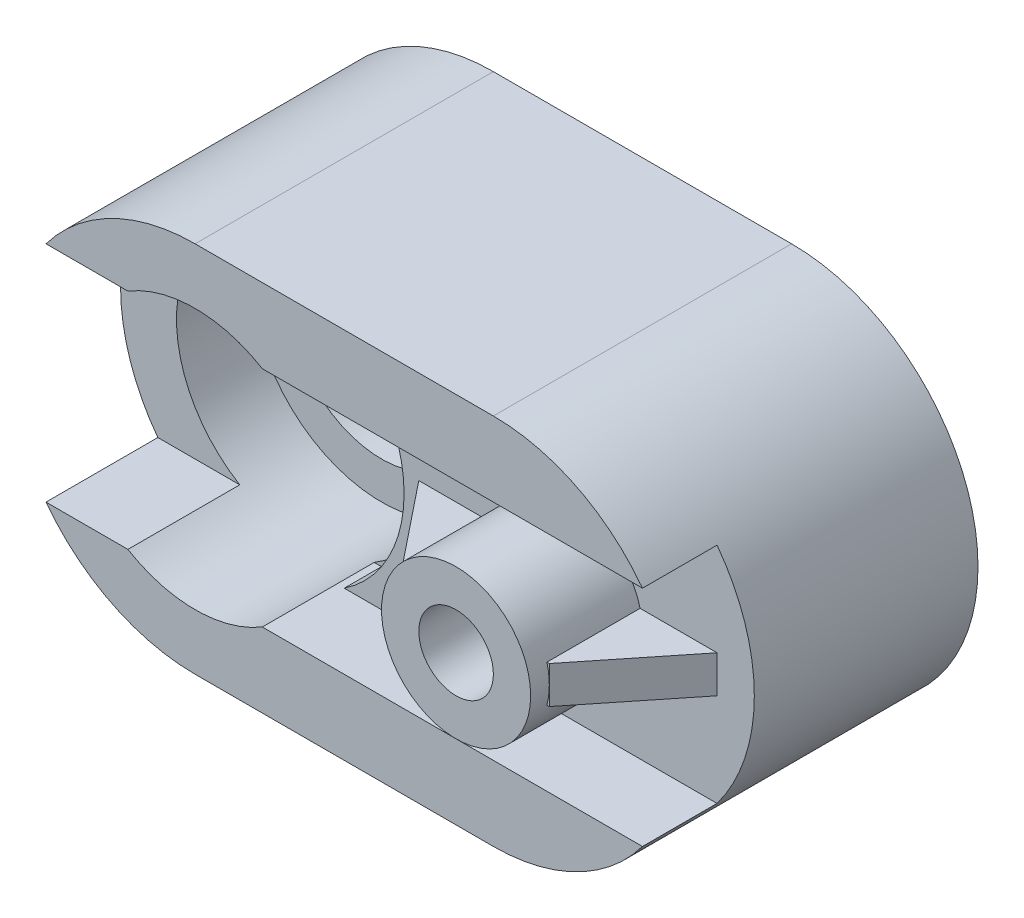
ISO-10303-21;
HEADER;
FILE_DESCRIPTION(('STEP AP214'),'2;1');
FILE_NAME('part.step','',(''),(''),'','','');
FILE_SCHEMA(('AUTOMOTIVE_DESIGN { 1 0 10303 214 1 1 1 1 }'));
ENDSEC;
DATA;
#1=APPLICATION_CONTEXT('core data for automotive mechanical design processes');
#2=APPLICATION_PROTOCOL_DEFINITION('international standard','automotive_design',2000,#1);
#3=PRODUCT_CONTEXT('',#1,'mechanical');
#4=PRODUCT('Part','Part','',(#3));
#5=PRODUCT_RELATED_PRODUCT_CATEGORY('part','',(#4));
#6=PRODUCT_DEFINITION_FORMATION('','',#4);
#7=PRODUCT_DEFINITION_CONTEXT('part definition',#1,'design');
#8=PRODUCT_DEFINITION('design','',#6,#7);
#9=PRODUCT_DEFINITION_SHAPE('','',#8);
#10=(LENGTH_UNIT() NAMED_UNIT(*) SI_UNIT(.MILLI.,.METRE.));
#11=(NAMED_UNIT(*) PLANE_ANGLE_UNIT() SI_UNIT($,.RADIAN.));
#12=(NAMED_UNIT(*) SI_UNIT($,.STERADIAN.) SOLID_ANGLE_UNIT());
#13=UNCERTAINTY_MEASURE_WITH_UNIT(LENGTH_MEASURE(1.E-05),#10,'distance_accuracy_value','');
#14=(GEOMETRIC_REPRESENTATION_CONTEXT(3) GLOBAL_UNCERTAINTY_ASSIGNED_CONTEXT((#13)) GLOBAL_UNIT_ASSIGNED_CONTEXT((#10,
#11,#12)) REPRESENTATION_CONTEXT('',''));
#15=CARTESIAN_POINT('',(0.,0.,0.));
#16=DIRECTION('',(0.,0.,1.));
#17=DIRECTION('',(1.,0.,0.));
#18=AXIS2_PLACEMENT_3D('',#15,#16,#17);
#19=CARTESIAN_POINT('',(0.,0.,85.));
#20=DIRECTION('',(0.,0.,1.));
#21=DIRECTION('',(1.,0.,0.));
#22=AXIS2_PLACEMENT_3D('',#19,#20,#21);
#23=PLANE('',#22);
#24=DIRECTION('',(-1.,0.,0.));
#25=VECTOR('',#24,1.);
#26=CARTESIAN_POINT('',(0.,45.,85.));
#27=LINE('',#26,#25);
#28=CARTESIAN_POINT('',(150.,45.,85.));
#29=VERTEX_POINT('',#28);
#30=CARTESIAN_POINT('',(149.364916731037,45.,85.));
#31=VERTEX_POINT('',#30);
#32=EDGE_CURVE('E324',#29,#31,#27,.T.);
#33=ORIENTED_EDGE('',*,*,#32,.F.);
#34=DIRECTION('',(0.,1.,0.));
#35=VECTOR('',#34,1.);
#36=CARTESIAN_POINT('',(150.,0.,85.));
#37=LINE('',#36,#35);
#38=CARTESIAN_POINT('',(150.,50.,85.));
#39=VERTEX_POINT('',#38);
#40=EDGE_CURVE('E49',#29,#39,#37,.T.);
#41=ORIENTED_EDGE('',*,*,#40,.T.);
#42=CARTESIAN_POINT('',(130.,50.,85.));
#43=DIRECTION('',(0.,0.,1.));
#44=DIRECTION('',(1.,0.,0.));
#45=AXIS2_PLACEMENT_3D('',#42,#43,#44);
#46=CIRCLE('',#45,20.);
#47=EDGE_CURVE('E331',#39,#31,#46,.F.);
#48=ORIENTED_EDGE('',*,*,#47,.T.);
#49=EDGE_LOOP('',(#33,#41,#48));
#50=FACE_BOUND('',#49,.T.);
#51=ADVANCED_FACE('F41',(#50),#23,.T.);
#52=CARTESIAN_POINT('',(0.,0.,85.));
#53=DIRECTION('',(0.,0.,1.));
#54=DIRECTION('',(1.,0.,0.));
#55=AXIS2_PLACEMENT_3D('',#52,#53,#54);
#56=PLANE('',#55);
#57=DIRECTION('',(1.,0.,0.));
#58=VECTOR('',#57,1.);
#59=CARTESIAN_POINT('',(0.,55.,85.));
#60=LINE('',#59,#58);
#61=CARTESIAN_POINT('',(110.,55.,85.));
#62=VERTEX_POINT('',#61);
#63=CARTESIAN_POINT('',(110.635083268963,55.,85.));
#64=VERTEX_POINT('',#63);
#65=EDGE_CURVE('E205',#62,#64,#60,.T.);
#66=ORIENTED_EDGE('',*,*,#65,.F.);
#67=DIRECTION('',(0.,-1.,0.));
#68=VECTOR('',#67,1.);
#69=CARTESIAN_POINT('',(110.,45.,85.));
#70=LINE('',#69,#68);
#71=CARTESIAN_POINT('',(110.,50.,85.));
#72=VERTEX_POINT('',#71);
#73=EDGE_CURVE('E311',#62,#72,#70,.T.);
#74=ORIENTED_EDGE('',*,*,#73,.T.);
#75=CARTESIAN_POINT('',(130.,50.,85.));
#76=DIRECTION('',(0.,0.,1.));
#77=DIRECTION('',(1.,0.,0.));
#78=AXIS2_PLACEMENT_3D('',#75,#76,#77);
#79=CIRCLE('',#78,20.);
#80=EDGE_CURVE('E348',#72,#64,#79,.F.);
#81=ORIENTED_EDGE('',*,*,#80,.T.);
#82=EDGE_LOOP('',(#66,#74,#81));
#83=FACE_BOUND('',#82,.T.);
#84=ADVANCED_FACE('F434',(#83),#56,.T.);
#85=CARTESIAN_POINT('',(209.,80.,60.));
#86=DIRECTION('',(0.,0.,1.));
#87=DIRECTION('',(1.,0.,0.));
#88=AXIS2_PLACEMENT_3D('',#85,#86,#87);
#89=PLANE('',#88);
#90=DIRECTION('',(-1.,0.,0.));
#91=VECTOR('',#90,1.);
#92=CARTESIAN_POINT('',(0.,55.,60.));
#93=LINE('',#92,#91);
#94=CARTESIAN_POINT('',(170.,55.,60.));
#95=VERTEX_POINT('',#94);
#96=CARTESIAN_POINT('',(149.364916731037,55.,60.));
#97=VERTEX_POINT('',#96);
#98=EDGE_CURVE('E337',#95,#97,#93,.T.);
#99=ORIENTED_EDGE('',*,*,#98,.F.);
#100=DIRECTION('',(0.,-1.,0.));
#101=VECTOR('',#100,1.);
#102=CARTESIAN_POINT('',(170.,0.,60.));
#103=LINE('',#102,#101);
#104=CARTESIAN_POINT('',(170.,45.,60.));
#105=VERTEX_POINT('',#104);
#106=EDGE_CURVE('E332',#95,#105,#103,.T.);
#107=ORIENTED_EDGE('',*,*,#106,.T.);
#108=DIRECTION('',(-1.,0.,0.));
#109=VECTOR('',#108,1.);
#110=CARTESIAN_POINT('',(0.,45.,60.));
#111=LINE('',#110,#109);
#112=CARTESIAN_POINT('',(149.364916731037,45.,60.));
#113=VERTEX_POINT('',#112);
#114=EDGE_CURVE('E327',#105,#113,#111,.T.);
#115=ORIENTED_EDGE('',*,*,#114,.T.);
#116=CARTESIAN_POINT('',(130.,50.,60.));
#117=DIRECTION('',(0.,0.,-1.));
#118=DIRECTION('',(1.,0.,0.));
#119=AXIS2_PLACEMENT_3D('',#116,#117,#118);
#120=CIRCLE('',#119,20.);
#121=CARTESIAN_POINT('',(110.635083268963,45.,60.));
#122=VERTEX_POINT('',#121);
#123=EDGE_CURVE('E226',#113,#122,#120,.T.);
#124=ORIENTED_EDGE('',*,*,#123,.T.);
#125=DIRECTION('',(1.,0.,0.));
#126=VECTOR('',#125,1.);
#127=CARTESIAN_POINT('',(0.,45.,60.));
#128=LINE('',#127,#126);
#129=CARTESIAN_POINT('',(90.,45.,60.));
#130=VERTEX_POINT('',#129);
#131=EDGE_CURVE('E352',#130,#122,#128,.T.);
#132=ORIENTED_EDGE('',*,*,#131,.F.);
#133=DIRECTION('',(0.,-1.,0.));
#134=VECTOR('',#133,1.);
#135=CARTESIAN_POINT('',(90.,0.,60.));
#136=LINE('',#135,#134);
#137=CARTESIAN_POINT('',(90.,55.,60.));
#138=VERTEX_POINT('',#137);
#139=EDGE_CURVE('E210',#138,#130,#136,.T.);
#140=ORIENTED_EDGE('',*,*,#139,.F.);
#141=DIRECTION('',(1.,0.,0.));
#142=VECTOR('',#141,1.);
#143=CARTESIAN_POINT('',(0.,55.,60.));
#144=LINE('',#143,#142);
#145=CARTESIAN_POINT('',(110.635083268963,55.,60.));
#146=VERTEX_POINT('',#145);
#147=EDGE_CURVE('E202',#138,#146,#144,.T.);
#148=ORIENTED_EDGE('',*,*,#147,.T.);
#149=EDGE_CURVE('E217',#146,#97,#120,.T.);
#150=ORIENTED_EDGE('',*,*,#149,.T.);
#151=EDGE_LOOP('',(#99,#107,#115,#124,#132,#140,#148,#150));
#152=FACE_BOUND('',#151,.T.);
#153=DIRECTION('',(-1.,0.,0.));
#154=VECTOR('',#153,1.);
#155=CARTESIAN_POINT('',(209.,80.,60.));
#156=LINE('',#155,#154);
#157=CARTESIAN_POINT('',(170.,80.,60.));
#158=VERTEX_POINT('',#157);
#159=CARTESIAN_POINT('',(70.,80.,60.));
#160=VERTEX_POINT('',#159);
#161=EDGE_CURVE('E253',#158,#160,#156,.T.);
#162=ORIENTED_EDGE('',*,*,#161,.T.);
#163=CARTESIAN_POINT('',(50.,50.,60.));
#164=DIRECTION('',(0.,0.,1.));
#165=DIRECTION('',(1.,0.,0.));
#166=AXIS2_PLACEMENT_3D('',#163,#164,#165);
#167=CIRCLE('',#166,36.0555127546399);
#168=CARTESIAN_POINT('',(70.,20.,60.));
#169=VERTEX_POINT('',#168);
#170=EDGE_CURVE('E380',#160,#169,#167,.F.);
#171=ORIENTED_EDGE('',*,*,#170,.T.);
#172=DIRECTION('',(-1.,0.,0.));
#173=VECTOR('',#172,1.);
#174=CARTESIAN_POINT('',(209.,20.,60.));
#175=LINE('',#174,#173);
#176=CARTESIAN_POINT('',(170.,20.,60.));
#177=VERTEX_POINT('',#176);
#178=EDGE_CURVE('E244',#177,#169,#175,.T.);
#179=ORIENTED_EDGE('',*,*,#178,.F.);
#180=CARTESIAN_POINT('',(130.,50.,60.));
#181=DIRECTION('',(0.,0.,1.));
#182=DIRECTION('',(1.,0.,0.));
#183=AXIS2_PLACEMENT_3D('',#180,#181,#182);
#184=CIRCLE('',#183,50.);
#185=EDGE_CURVE('E262',#158,#177,#184,.F.);
#186=ORIENTED_EDGE('',*,*,#185,.F.);
#187=EDGE_LOOP('',(#162,#171,#179,#186));
#188=FACE_BOUND('',#187,.T.);
#189=ADVANCED_FACE('F215',(#152,#188),#89,.T.);
#190=CARTESIAN_POINT('',(130.,50.,90.));
#191=DIRECTION('',(0.,0.,-1.));
#192=DIRECTION('',(-1.,0.,0.));
#193=AXIS2_PLACEMENT_3D('',#190,#191,#192);
#194=CYLINDRICAL_SURFACE('',#193,20.);
#195=CARTESIAN_POINT('',(130.,50.,90.));
#196=DIRECTION('',(0.,0.,1.));
#197=DIRECTION('',(1.,0.,0.));
#198=AXIS2_PLACEMENT_3D('',#195,#196,#197);
#199=CIRCLE('',#198,20.);
#200=CARTESIAN_POINT('',(150.,50.,90.));
#201=VERTEX_POINT('',#200);
#202=EDGE_CURVE('E241',#201,#201,#199,.T.);
#203=ORIENTED_EDGE('',*,*,#202,.F.);
#204=EDGE_LOOP('',(#203));
#205=FACE_BOUND('',#204,.T.);
#206=CARTESIAN_POINT('',(149.364916731037,55.,85.));
#207=VERTEX_POINT('',#206);
#208=EDGE_CURVE('E356',#207,#39,#46,.F.);
#209=ORIENTED_EDGE('',*,*,#208,.F.);
#210=DIRECTION('',(0.,0.,1.));
#211=VECTOR('',#210,1.);
#212=CARTESIAN_POINT('',(149.364916731037,55.,60.));
#213=LINE('',#212,#211);
#214=EDGE_CURVE('E225',#97,#207,#213,.T.);
#215=ORIENTED_EDGE('',*,*,#214,.F.);
#216=ORIENTED_EDGE('',*,*,#149,.F.);
#217=DIRECTION('',(0.,0.,1.));
#218=VECTOR('',#217,1.);
#219=CARTESIAN_POINT('',(110.635083268963,55.,60.));
#220=LINE('',#219,#218);
#221=EDGE_CURVE('E199',#146,#64,#220,.T.);
#222=ORIENTED_EDGE('',*,*,#221,.T.);
#223=ORIENTED_EDGE('',*,*,#80,.F.);
#224=CARTESIAN_POINT('',(110.635083268963,45.,85.));
#225=VERTEX_POINT('',#224);
#226=EDGE_CURVE('E344',#225,#72,#79,.F.);
#227=ORIENTED_EDGE('',*,*,#226,.F.);
#228=DIRECTION('',(0.,0.,-1.));
#229=VECTOR('',#228,1.);
#230=CARTESIAN_POINT('',(110.635083268963,45.,85.));
#231=LINE('',#230,#229);
#232=EDGE_CURVE('E350',#225,#122,#231,.T.);
#233=ORIENTED_EDGE('',*,*,#232,.T.);
#234=ORIENTED_EDGE('',*,*,#123,.F.);
#235=DIRECTION('',(0.,0.,-1.));
#236=VECTOR('',#235,1.);
#237=CARTESIAN_POINT('',(149.364916731037,45.,85.));
#238=LINE('',#237,#236);
#239=EDGE_CURVE('E358',#31,#113,#238,.T.);
#240=ORIENTED_EDGE('',*,*,#239,.F.);
#241=ORIENTED_EDGE('',*,*,#47,.F.);
#242=EDGE_LOOP('',(#209,#215,#216,#222,#223,#227,#233,#234,#240,#241));
#243=FACE_BOUND('',#242,.T.);
#244=ADVANCED_FACE('F223',(#205,#243),#194,.T.);
#245=CARTESIAN_POINT('',(209.,80.,80.));
#246=DIRECTION('',(0.,-1.,0.));
#247=DIRECTION('',(0.,0.,-1.));
#248=AXIS2_PLACEMENT_3D('',#245,#246,#247);
#249=PLANE('',#248);
#250=DIRECTION('',(1.,0.,0.));
#251=VECTOR('',#250,1.);
#252=CARTESIAN_POINT('',(0.,80.,80.));
#253=LINE('',#252,#251);
#254=CARTESIAN_POINT('',(68.02775637732,80.,80.));
#255=VERTEX_POINT('',#254);
#256=CARTESIAN_POINT('',(170.,80.,80.));
#257=VERTEX_POINT('',#256);
#258=EDGE_CURVE('E298',#255,#257,#253,.T.);
#259=ORIENTED_EDGE('',*,*,#258,.F.);
#260=DIRECTION('',(0.,0.,1.));
#261=VECTOR('',#260,1.);
#262=CARTESIAN_POINT('',(68.02775637732,80.,30.));
#263=LINE('',#262,#261);
#264=CARTESIAN_POINT('',(68.02775637732,80.,50.));
#265=VERTEX_POINT('',#264);
#266=EDGE_CURVE('E374',#265,#255,#263,.T.);
#267=ORIENTED_EDGE('',*,*,#266,.F.);
#268=DIRECTION('',(-1.,0.,0.));
#269=VECTOR('',#268,1.);
#270=CARTESIAN_POINT('',(0.,80.,50.));
#271=LINE('',#270,#269);
#272=CARTESIAN_POINT('',(70.,80.,50.));
#273=VERTEX_POINT('',#272);
#274=EDGE_CURVE('E385',#273,#265,#271,.T.);
#275=ORIENTED_EDGE('',*,*,#274,.F.);
#276=DIRECTION('',(0.,0.,1.));
#277=VECTOR('',#276,1.);
#278=CARTESIAN_POINT('',(70.,80.,50.));
#279=LINE('',#278,#277);
#280=EDGE_CURVE('E395',#273,#160,#279,.T.);
#281=ORIENTED_EDGE('',*,*,#280,.T.);
#282=ORIENTED_EDGE('',*,*,#161,.F.);
#283=DIRECTION('',(0.,0.,-1.));
#284=VECTOR('',#283,1.);
#285=CARTESIAN_POINT('',(170.,80.,80.));
#286=LINE('',#285,#284);
#287=EDGE_CURVE('E259',#257,#158,#286,.T.);
#288=ORIENTED_EDGE('',*,*,#287,.F.);
#289=EDGE_LOOP('',(#259,#267,#275,#281,#282,#288));
#290=FACE_BOUND('',#289,.T.);
#291=ADVANCED_FACE('F510',(#290),#249,.T.);
#292=CARTESIAN_POINT('',(209.,20.,80.));
#293=DIRECTION('',(0.,1.,0.));
#294=DIRECTION('',(0.,0.,1.));
#295=AXIS2_PLACEMENT_3D('',#292,#293,#294);
#296=PLANE('',#295);
#297=DIRECTION('',(-1.,0.,0.));
#298=VECTOR('',#297,1.);
#299=CARTESIAN_POINT('',(0.,20.,80.));
#300=LINE('',#299,#298);
#301=CARTESIAN_POINT('',(31.9722436226801,20.,80.));
#302=VERTEX_POINT('',#301);
#303=CARTESIAN_POINT('',(10.,20.,80.));
#304=VERTEX_POINT('',#303);
#305=EDGE_CURVE('E302',#302,#304,#300,.T.);
#306=ORIENTED_EDGE('',*,*,#305,.F.);
#307=DIRECTION('',(0.,0.,1.));
#308=VECTOR('',#307,1.);
#309=CARTESIAN_POINT('',(31.9722436226801,20.,30.));
#310=LINE('',#309,#308);
#311=CARTESIAN_POINT('',(31.9722436226801,20.,50.));
#312=VERTEX_POINT('',#311);
#313=EDGE_CURVE('E376',#312,#302,#310,.T.);
#314=ORIENTED_EDGE('',*,*,#313,.F.);
#315=DIRECTION('',(1.,0.,0.));
#316=VECTOR('',#315,1.);
#317=CARTESIAN_POINT('',(0.,20.,50.));
#318=LINE('',#317,#316);
#319=CARTESIAN_POINT('',(10.,20.,50.));
#320=VERTEX_POINT('',#319);
#321=EDGE_CURVE('E392',#320,#312,#318,.T.);
#322=ORIENTED_EDGE('',*,*,#321,.F.);
#323=DIRECTION('',(0.,0.,-1.));
#324=VECTOR('',#323,1.);
#325=CARTESIAN_POINT('',(10.,20.,80.));
#326=LINE('',#325,#324);
#327=EDGE_CURVE('E247',#320,#304,#326,.F.);
#328=ORIENTED_EDGE('',*,*,#327,.T.);
#329=EDGE_LOOP('',(#306,#314,#322,#328));
#330=FACE_BOUND('',#329,.T.);
#331=ADVANCED_FACE('F412',(#330),#296,.T.);
#332=CARTESIAN_POINT('',(50.,50.,20.));
#333=DIRECTION('',(0.,0.,1.));
#334=DIRECTION('',(1.,0.,0.));
#335=AXIS2_PLACEMENT_3D('',#332,#333,#334);
#336=CYLINDRICAL_SURFACE('',#335,25.);
#337=CARTESIAN_POINT('',(50.,50.,20.));
#338=DIRECTION('',(0.,0.,1.));
#339=DIRECTION('',(1.,0.,0.));
#340=AXIS2_PLACEMENT_3D('',#337,#338,#339);
#341=CIRCLE('',#340,25.);
#342=CARTESIAN_POINT('',(75.,50.,20.));
#343=VERTEX_POINT('',#342);
#344=EDGE_CURVE('E232',#343,#343,#341,.T.);
#345=ORIENTED_EDGE('',*,*,#344,.F.);
#346=EDGE_LOOP('',(#345));
#347=FACE_BOUND('',#346,.T.);
#348=CARTESIAN_POINT('',(50.,50.,30.));
#349=DIRECTION('',(0.,0.,1.));
#350=DIRECTION('',(1.,0.,0.));
#351=AXIS2_PLACEMENT_3D('',#348,#349,#350);
#352=CIRCLE('',#351,25.);
#353=CARTESIAN_POINT('',(75.,50.,30.));
#354=VERTEX_POINT('',#353);
#355=EDGE_CURVE('E366',#354,#354,#352,.T.);
#356=ORIENTED_EDGE('',*,*,#355,.T.);
#357=EDGE_LOOP('',(#356));
#358=FACE_BOUND('',#357,.T.);
#359=ADVANCED_FACE('F408',(#347,#358),#336,.F.);
#360=CARTESIAN_POINT('',(0.,0.,50.));
#361=DIRECTION('',(0.,0.,1.));
#362=DIRECTION('',(1.,0.,0.));
#363=AXIS2_PLACEMENT_3D('',#360,#361,#362);
#364=PLANE('',#363);
#365=CARTESIAN_POINT('',(50.,50.,50.));
#366=DIRECTION('',(0.,0.,1.));
#367=DIRECTION('',(1.,0.,0.));
#368=AXIS2_PLACEMENT_3D('',#365,#366,#367);
#369=CIRCLE('',#368,35.);
#370=CARTESIAN_POINT('',(31.9722436226801,80.,50.));
#371=VERTEX_POINT('',#370);
#372=EDGE_CURVE('E308',#371,#312,#369,.T.);
#373=ORIENTED_EDGE('',*,*,#372,.F.);
#374=CARTESIAN_POINT('',(10.,80.,50.));
#375=VERTEX_POINT('',#374);
#376=EDGE_CURVE('E384',#371,#375,#271,.T.);
#377=ORIENTED_EDGE('',*,*,#376,.T.);
#378=CARTESIAN_POINT('',(50.,50.,50.));
#379=DIRECTION('',(0.,0.,1.));
#380=DIRECTION('',(1.,0.,0.));
#381=AXIS2_PLACEMENT_3D('',#378,#379,#380);
#382=CIRCLE('',#381,50.);
#383=EDGE_CURVE('E388',#375,#320,#382,.T.);
#384=ORIENTED_EDGE('',*,*,#383,.T.);
#385=ORIENTED_EDGE('',*,*,#321,.T.);
#386=EDGE_LOOP('',(#373,#377,#384,#385));
#387=FACE_BOUND('',#386,.T.);
#388=ADVANCED_FACE('F411',(#387),#364,.T.);
#389=CARTESIAN_POINT('',(50.,50.,-14.));
#390=DIRECTION('',(0.,0.,1.));
#391=DIRECTION('',(1.,0.,0.));
#392=AXIS2_PLACEMENT_3D('',#389,#390,#391);
#393=CYLINDRICAL_SURFACE('',#392,10.);
#394=CARTESIAN_POINT('',(50.,50.,0.));
#395=DIRECTION('',(0.,0.,1.));
#396=DIRECTION('',(1.,0.,0.));
#397=AXIS2_PLACEMENT_3D('',#394,#395,#396);
#398=CIRCLE('',#397,10.);
#399=CARTESIAN_POINT('',(60.,50.,0.));
#400=VERTEX_POINT('',#399);
#401=EDGE_CURVE('E227',#400,#400,#398,.T.);
#402=ORIENTED_EDGE('',*,*,#401,.F.);
#403=EDGE_LOOP('',(#402));
#404=FACE_BOUND('',#403,.T.);
#405=CARTESIAN_POINT('',(50.,50.,20.));
#406=DIRECTION('',(0.,0.,1.));
#407=DIRECTION('',(1.,0.,0.));
#408=AXIS2_PLACEMENT_3D('',#405,#406,#407);
#409=CIRCLE('',#408,10.);
#410=CARTESIAN_POINT('',(60.,50.,20.));
#411=VERTEX_POINT('',#410);
#412=EDGE_CURVE('E400',#411,#411,#409,.T.);
#413=ORIENTED_EDGE('',*,*,#412,.T.);
#414=EDGE_LOOP('',(#413));
#415=FACE_BOUND('',#414,.T.);
#416=ADVANCED_FACE('F492',(#404,#415),#393,.F.);
#417=CARTESIAN_POINT('',(50.,50.,80.));
#418=DIRECTION('',(0.,0.,-1.));
#419=DIRECTION('',(-1.,0.,0.));
#420=AXIS2_PLACEMENT_3D('',#417,#418,#419);
#421=CYLINDRICAL_SURFACE('',#420,50.);
#422=ORIENTED_EDGE('',*,*,#327,.F.);
#423=ORIENTED_EDGE('',*,*,#383,.F.);
#424=DIRECTION('',(0.,0.,-1.));
#425=VECTOR('',#424,1.);
#426=CARTESIAN_POINT('',(10.,80.,80.));
#427=LINE('',#426,#425);
#428=CARTESIAN_POINT('',(10.,80.,80.));
#429=VERTEX_POINT('',#428);
#430=EDGE_CURVE('E256',#429,#375,#427,.T.);
#431=ORIENTED_EDGE('',*,*,#430,.F.);
#432=CARTESIAN_POINT('',(50.,50.,80.));
#433=DIRECTION('',(0.,0.,1.));
#434=DIRECTION('',(1.,0.,0.));
#435=AXIS2_PLACEMENT_3D('',#432,#433,#434);
#436=CIRCLE('',#435,50.);
#437=CARTESIAN_POINT('',(50.,100.,80.));
#438=VERTEX_POINT('',#437);
#439=EDGE_CURVE('E273',#438,#429,#436,.T.);
#440=ORIENTED_EDGE('',*,*,#439,.F.);
#441=DIRECTION('',(0.,0.,-1.));
#442=VECTOR('',#441,1.);
#443=CARTESIAN_POINT('',(50.,100.,80.));
#444=LINE('',#443,#442);
#445=CARTESIAN_POINT('',(50.,100.,0.));
#446=VERTEX_POINT('',#445);
#447=EDGE_CURVE('E294',#438,#446,#444,.T.);
#448=ORIENTED_EDGE('',*,*,#447,.T.);
#449=CARTESIAN_POINT('',(50.,50.,0.));
#450=DIRECTION('',(0.,0.,1.));
#451=DIRECTION('',(1.,0.,0.));
#452=AXIS2_PLACEMENT_3D('',#449,#450,#451);
#453=CIRCLE('',#452,50.);
#454=CARTESIAN_POINT('',(50.,0.,0.));
#455=VERTEX_POINT('',#454);
#456=EDGE_CURVE('E285',#446,#455,#453,.T.);
#457=ORIENTED_EDGE('',*,*,#456,.T.);
#458=DIRECTION('',(0.,0.,-1.));
#459=VECTOR('',#458,1.);
#460=CARTESIAN_POINT('',(50.,0.,80.));
#461=LINE('',#460,#459);
#462=CARTESIAN_POINT('',(50.,0.,80.));
#463=VERTEX_POINT('',#462);
#464=EDGE_CURVE('E291',#463,#455,#461,.T.);
#465=ORIENTED_EDGE('',*,*,#464,.F.);
#466=EDGE_CURVE('E272',#304,#463,#436,.T.);
#467=ORIENTED_EDGE('',*,*,#466,.F.);
#468=EDGE_LOOP('',(#422,#423,#431,#440,#448,#457,#465,#467));
#469=FACE_BOUND('',#468,.T.);
#470=ADVANCED_FACE('F482',(#469),#421,.T.);
#471=CARTESIAN_POINT('',(130.,50.,80.));
#472=DIRECTION('',(0.,0.,-1.));
#473=DIRECTION('',(-1.,0.,0.));
#474=AXIS2_PLACEMENT_3D('',#471,#472,#473);
#475=CYLINDRICAL_SURFACE('',#474,50.);
#476=ORIENTED_EDGE('',*,*,#185,.T.);
#477=DIRECTION('',(0.,0.,-1.));
#478=VECTOR('',#477,1.);
#479=CARTESIAN_POINT('',(170.,20.,80.));
#480=LINE('',#479,#478);
#481=CARTESIAN_POINT('',(170.,20.,80.));
#482=VERTEX_POINT('',#481);
#483=EDGE_CURVE('E250',#177,#482,#480,.F.);
#484=ORIENTED_EDGE('',*,*,#483,.T.);
#485=CARTESIAN_POINT('',(130.,50.,80.));
#486=DIRECTION('',(0.,0.,1.));
#487=DIRECTION('',(1.,0.,0.));
#488=AXIS2_PLACEMENT_3D('',#485,#486,#487);
#489=CIRCLE('',#488,50.);
#490=CARTESIAN_POINT('',(130.,0.,80.));
#491=VERTEX_POINT('',#490);
#492=EDGE_CURVE('E269',#482,#491,#489,.F.);
#493=ORIENTED_EDGE('',*,*,#492,.T.);
#494=DIRECTION('',(0.,0.,-1.));
#495=VECTOR('',#494,1.);
#496=CARTESIAN_POINT('',(130.,0.,80.));
#497=LINE('',#496,#495);
#498=CARTESIAN_POINT('',(130.,0.,0.));
#499=VERTEX_POINT('',#498);
#500=EDGE_CURVE('E279',#491,#499,#497,.T.);
#501=ORIENTED_EDGE('',*,*,#500,.T.);
#502=CARTESIAN_POINT('',(130.,50.,0.));
#503=DIRECTION('',(0.,0.,1.));
#504=DIRECTION('',(1.,0.,0.));
#505=AXIS2_PLACEMENT_3D('',#502,#503,#504);
#506=CIRCLE('',#505,50.);
#507=CARTESIAN_POINT('',(130.,100.,0.));
#508=VERTEX_POINT('',#507);
#509=EDGE_CURVE('E264',#508,#499,#506,.F.);
#510=ORIENTED_EDGE('',*,*,#509,.F.);
#511=DIRECTION('',(0.,0.,-1.));
#512=VECTOR('',#511,1.);
#513=CARTESIAN_POINT('',(130.,100.,80.));
#514=LINE('',#513,#512);
#515=CARTESIAN_POINT('',(130.,100.,80.));
#516=VERTEX_POINT('',#515);
#517=EDGE_CURVE('E296',#516,#508,#514,.T.);
#518=ORIENTED_EDGE('',*,*,#517,.F.);
#519=EDGE_CURVE('E265',#516,#257,#489,.F.);
#520=ORIENTED_EDGE('',*,*,#519,.T.);
#521=ORIENTED_EDGE('',*,*,#287,.T.);
#522=EDGE_LOOP('',(#476,#484,#493,#501,#510,#518,#520,#521));
#523=FACE_BOUND('',#522,.T.);
#524=ADVANCED_FACE('F478',(#523),#475,.T.);
#525=CARTESIAN_POINT('',(0.,0.,80.));
#526=DIRECTION('',(0.,0.,1.));
#527=DIRECTION('',(1.,0.,0.));
#528=AXIS2_PLACEMENT_3D('',#525,#526,#527);
#529=PLANE('',#528);
#530=CARTESIAN_POINT('',(50.,50.,80.));
#531=DIRECTION('',(0.,0.,1.));
#532=DIRECTION('',(1.,0.,0.));
#533=AXIS2_PLACEMENT_3D('',#530,#531,#532);
#534=CIRCLE('',#533,35.);
#535=CARTESIAN_POINT('',(68.0277563773199,20.,80.));
#536=VERTEX_POINT('',#535);
#537=EDGE_CURVE('E362',#302,#536,#534,.T.);
#538=ORIENTED_EDGE('',*,*,#537,.F.);
#539=ORIENTED_EDGE('',*,*,#305,.T.);
#540=ORIENTED_EDGE('',*,*,#466,.T.);
#541=DIRECTION('',(1.,0.,0.));
#542=VECTOR('',#541,1.);
#543=CARTESIAN_POINT('',(0.,0.,80.));
#544=LINE('',#543,#542);
#545=EDGE_CURVE('E276',#463,#491,#544,.T.);
#546=ORIENTED_EDGE('',*,*,#545,.T.);
#547=ORIENTED_EDGE('',*,*,#492,.F.);
#548=EDGE_CURVE('E303',#482,#536,#300,.T.);
#549=ORIENTED_EDGE('',*,*,#548,.T.);
#550=EDGE_LOOP('',(#538,#539,#540,#546,#547,#549));
#551=FACE_BOUND('',#550,.T.);
#552=ADVANCED_FACE('F481',(#551),#529,.T.);
#553=CARTESIAN_POINT('',(31.9722436226801,80.,80.));
#554=VERTEX_POINT('',#553);
#555=EDGE_CURVE('E363',#255,#554,#534,.T.);
#556=ORIENTED_EDGE('',*,*,#555,.F.);
#557=ORIENTED_EDGE('',*,*,#258,.T.);
#558=ORIENTED_EDGE('',*,*,#519,.F.);
#559=DIRECTION('',(1.,0.,0.));
#560=VECTOR('',#559,1.);
#561=CARTESIAN_POINT('',(0.,100.,80.));
#562=LINE('',#561,#560);
#563=EDGE_CURVE('E268',#438,#516,#562,.T.);
#564=ORIENTED_EDGE('',*,*,#563,.F.);
#565=ORIENTED_EDGE('',*,*,#439,.T.);
#566=EDGE_CURVE('E299',#429,#554,#253,.T.);
#567=ORIENTED_EDGE('',*,*,#566,.T.);
#568=EDGE_LOOP('',(#556,#557,#558,#564,#565,#567));
#569=FACE_BOUND('',#568,.T.);
#570=ADVANCED_FACE('F488',(#569),#529,.T.);
#571=CARTESIAN_POINT('',(0.,100.,80.));
#572=DIRECTION('',(0.,1.,0.));
#573=DIRECTION('',(0.,0.,1.));
#574=AXIS2_PLACEMENT_3D('',#571,#572,#573);
#575=PLANE('',#574);
#576=DIRECTION('',(1.,0.,0.));
#577=VECTOR('',#576,1.);
#578=CARTESIAN_POINT('',(0.,100.,0.));
#579=LINE('',#578,#577);
#580=EDGE_CURVE('E282',#446,#508,#579,.T.);
#581=ORIENTED_EDGE('',*,*,#580,.F.);
#582=ORIENTED_EDGE('',*,*,#447,.F.);
#583=ORIENTED_EDGE('',*,*,#563,.T.);
#584=ORIENTED_EDGE('',*,*,#517,.T.);
#585=EDGE_LOOP('',(#581,#582,#583,#584));
#586=FACE_BOUND('',#585,.T.);
#587=ADVANCED_FACE('F484',(#586),#575,.T.);
#588=CARTESIAN_POINT('',(0.,0.,80.));
#589=DIRECTION('',(0.,1.,0.));
#590=DIRECTION('',(0.,0.,1.));
#591=AXIS2_PLACEMENT_3D('',#588,#589,#590);
#592=PLANE('',#591);
#593=DIRECTION('',(1.,0.,0.));
#594=VECTOR('',#593,1.);
#595=CARTESIAN_POINT('',(0.,0.,0.));
#596=LINE('',#595,#594);
#597=EDGE_CURVE('E287',#455,#499,#596,.T.);
#598=ORIENTED_EDGE('',*,*,#597,.T.);
#599=ORIENTED_EDGE('',*,*,#500,.F.);
#600=ORIENTED_EDGE('',*,*,#545,.F.);
#601=ORIENTED_EDGE('',*,*,#464,.T.);
#602=EDGE_LOOP('',(#598,#599,#600,#601));
#603=FACE_BOUND('',#602,.T.);
#604=ADVANCED_FACE('F487',(#603),#592,.F.);
#605=CARTESIAN_POINT('',(0.,0.,0.));
#606=DIRECTION('',(0.,0.,1.));
#607=DIRECTION('',(1.,0.,0.));
#608=AXIS2_PLACEMENT_3D('',#605,#606,#607);
#609=PLANE('',#608);
#610=ORIENTED_EDGE('',*,*,#401,.T.);
#611=EDGE_LOOP('',(#610));
#612=FACE_BOUND('',#611,.T.);
#613=ORIENTED_EDGE('',*,*,#509,.T.);
#614=ORIENTED_EDGE('',*,*,#597,.F.);
#615=ORIENTED_EDGE('',*,*,#456,.F.);
#616=ORIENTED_EDGE('',*,*,#580,.T.);
#617=EDGE_LOOP('',(#613,#614,#615,#616));
#618=FACE_BOUND('',#617,.T.);
#619=ADVANCED_FACE('F496',(#612,#618),#609,.F.);
#620=DIRECTION('',(0.,0.,1.));
#621=VECTOR('',#620,1.);
#622=CARTESIAN_POINT('',(31.9722436226801,80.,30.));
#623=LINE('',#622,#621);
#624=EDGE_CURVE('E378',#554,#371,#623,.F.);
#625=ORIENTED_EDGE('',*,*,#624,.F.);
#626=ORIENTED_EDGE('',*,*,#566,.F.);
#627=ORIENTED_EDGE('',*,*,#430,.T.);
#628=ORIENTED_EDGE('',*,*,#376,.F.);
#629=EDGE_LOOP('',(#625,#626,#627,#628));
#630=FACE_BOUND('',#629,.T.);
#631=ADVANCED_FACE('F500',(#630),#249,.T.);
#632=DIRECTION('',(0.,0.,1.));
#633=VECTOR('',#632,1.);
#634=CARTESIAN_POINT('',(68.0277563773199,20.,30.));
#635=LINE('',#634,#633);
#636=CARTESIAN_POINT('',(68.0277563773199,20.,50.));
#637=VERTEX_POINT('',#636);
#638=EDGE_CURVE('E372',#536,#637,#635,.F.);
#639=ORIENTED_EDGE('',*,*,#638,.F.);
#640=ORIENTED_EDGE('',*,*,#548,.F.);
#641=ORIENTED_EDGE('',*,*,#483,.F.);
#642=ORIENTED_EDGE('',*,*,#178,.T.);
#643=DIRECTION('',(0.,0.,1.));
#644=VECTOR('',#643,1.);
#645=CARTESIAN_POINT('',(70.,20.,50.));
#646=LINE('',#645,#644);
#647=CARTESIAN_POINT('',(70.,20.,50.));
#648=VERTEX_POINT('',#647);
#649=EDGE_CURVE('E398',#648,#169,#646,.T.);
#650=ORIENTED_EDGE('',*,*,#649,.F.);
#651=EDGE_CURVE('E391',#637,#648,#318,.T.);
#652=ORIENTED_EDGE('',*,*,#651,.F.);
#653=EDGE_LOOP('',(#639,#640,#641,#642,#650,#652));
#654=FACE_BOUND('',#653,.T.);
#655=ADVANCED_FACE('F508',(#654),#296,.T.);
#656=CARTESIAN_POINT('',(130.,50.,90.));
#657=DIRECTION('',(0.,0.,1.));
#658=DIRECTION('',(1.,0.,0.));
#659=AXIS2_PLACEMENT_3D('',#656,#657,#658);
#660=PLANE('',#659);
#661=ORIENTED_EDGE('',*,*,#202,.T.);
#662=EDGE_LOOP('',(#661));
#663=FACE_BOUND('',#662,.T.);
#664=CARTESIAN_POINT('',(130.,50.,90.));
#665=DIRECTION('',(0.,0.,1.));
#666=DIRECTION('',(1.,0.,0.));
#667=AXIS2_PLACEMENT_3D('',#664,#665,#666);
#668=CIRCLE('',#667,10.);
#669=CARTESIAN_POINT('',(140.,50.,90.));
#670=VERTEX_POINT('',#669);
#671=EDGE_CURVE('E238',#670,#670,#668,.T.);
#672=ORIENTED_EDGE('',*,*,#671,.F.);
#673=EDGE_LOOP('',(#672));
#674=FACE_BOUND('',#673,.T.);
#675=ADVANCED_FACE('F513',(#663,#674),#660,.T.);
#676=CARTESIAN_POINT('',(130.,50.,40.));
#677=DIRECTION('',(0.,0.,1.));
#678=DIRECTION('',(1.,0.,0.));
#679=AXIS2_PLACEMENT_3D('',#676,#677,#678);
#680=CYLINDRICAL_SURFACE('',#679,10.);
#681=CARTESIAN_POINT('',(130.,50.,40.));
#682=DIRECTION('',(0.,0.,1.));
#683=DIRECTION('',(1.,0.,0.));
#684=AXIS2_PLACEMENT_3D('',#681,#682,#683);
#685=CIRCLE('',#684,9.99999999999998);
#686=CARTESIAN_POINT('',(140.,50.,40.));
#687=VERTEX_POINT('',#686);
#688=EDGE_CURVE('E230',#687,#687,#685,.T.);
#689=ORIENTED_EDGE('',*,*,#688,.F.);
#690=EDGE_LOOP('',(#689));
#691=FACE_BOUND('',#690,.T.);
#692=ORIENTED_EDGE('',*,*,#671,.T.);
#693=EDGE_LOOP('',(#692));
#694=FACE_BOUND('',#693,.T.);
#695=ADVANCED_FACE('F515',(#691,#694),#680,.F.);
#696=CARTESIAN_POINT('',(130.,50.,40.));
#697=DIRECTION('',(0.,0.,1.));
#698=DIRECTION('',(1.,0.,0.));
#699=AXIS2_PLACEMENT_3D('',#696,#697,#698);
#700=CONICAL_SURFACE('',#699,9.99999999999998,1.02974425867666);
#701=CARTESIAN_POINT('',(130.,50.,33.9913938097244));
#702=VERTEX_POINT('',#701);
#703=VERTEX_LOOP('',#702);
#704=FACE_BOUND('',#703,.T.);
#705=ORIENTED_EDGE('',*,*,#688,.T.);
#706=EDGE_LOOP('',(#705));
#707=FACE_BOUND('',#706,.T.);
#708=ADVANCED_FACE('F518',(#704,#707),#700,.F.);
#709=CARTESIAN_POINT('',(50.,50.,20.));
#710=DIRECTION('',(0.,0.,1.));
#711=DIRECTION('',(1.,0.,0.));
#712=AXIS2_PLACEMENT_3D('',#709,#710,#711);
#713=PLANE('',#712);
#714=ORIENTED_EDGE('',*,*,#412,.F.);
#715=EDGE_LOOP('',(#714));
#716=FACE_BOUND('',#715,.T.);
#717=ORIENTED_EDGE('',*,*,#344,.T.);
#718=EDGE_LOOP('',(#717));
#719=FACE_BOUND('',#718,.T.);
#720=ADVANCED_FACE('F406',(#716,#719),#713,.T.);
#721=CARTESIAN_POINT('',(50.,50.,50.));
#722=DIRECTION('',(0.,0.,1.));
#723=DIRECTION('',(1.,0.,0.));
#724=AXIS2_PLACEMENT_3D('',#721,#722,#723);
#725=CYLINDRICAL_SURFACE('',#724,36.0555127546399);
#726=ORIENTED_EDGE('',*,*,#170,.F.);
#727=ORIENTED_EDGE('',*,*,#280,.F.);
#728=CARTESIAN_POINT('',(50.,50.,50.));
#729=DIRECTION('',(0.,0.,1.));
#730=DIRECTION('',(1.,0.,0.));
#731=AXIS2_PLACEMENT_3D('',#728,#729,#730);
#732=CIRCLE('',#731,36.0555127546399);
#733=EDGE_CURVE('E381',#273,#648,#732,.F.);
#734=ORIENTED_EDGE('',*,*,#733,.T.);
#735=ORIENTED_EDGE('',*,*,#649,.T.);
#736=EDGE_LOOP('',(#726,#727,#734,#735));
#737=FACE_BOUND('',#736,.T.);
#738=ADVANCED_FACE('F430',(#737),#725,.F.);
#739=EDGE_CURVE('E306',#637,#265,#369,.T.);
#740=ORIENTED_EDGE('',*,*,#739,.F.);
#741=ORIENTED_EDGE('',*,*,#651,.T.);
#742=ORIENTED_EDGE('',*,*,#733,.F.);
#743=ORIENTED_EDGE('',*,*,#274,.T.);
#744=EDGE_LOOP('',(#740,#741,#742,#743));
#745=FACE_BOUND('',#744,.T.);
#746=ADVANCED_FACE('F424',(#745),#364,.T.);
#747=CARTESIAN_POINT('',(50.,50.,30.));
#748=DIRECTION('',(0.,0.,1.));
#749=DIRECTION('',(1.,0.,0.));
#750=AXIS2_PLACEMENT_3D('',#747,#748,#749);
#751=CYLINDRICAL_SURFACE('',#750,35.);
#752=ORIENTED_EDGE('',*,*,#624,.T.);
#753=ORIENTED_EDGE('',*,*,#372,.T.);
#754=ORIENTED_EDGE('',*,*,#313,.T.);
#755=ORIENTED_EDGE('',*,*,#537,.T.);
#756=ORIENTED_EDGE('',*,*,#638,.T.);
#757=ORIENTED_EDGE('',*,*,#739,.T.);
#758=ORIENTED_EDGE('',*,*,#266,.T.);
#759=ORIENTED_EDGE('',*,*,#555,.T.);
#760=EDGE_LOOP('',(#752,#753,#754,#755,#756,#757,#758,#759));
#761=FACE_BOUND('',#760,.T.);
#762=CARTESIAN_POINT('',(50.,50.,30.));
#763=DIRECTION('',(0.,0.,1.));
#764=DIRECTION('',(1.,0.,0.));
#765=AXIS2_PLACEMENT_3D('',#762,#763,#764);
#766=CIRCLE('',#765,35.);
#767=CARTESIAN_POINT('',(85.,50.,30.));
#768=VERTEX_POINT('',#767);
#769=EDGE_CURVE('E369',#768,#768,#766,.T.);
#770=ORIENTED_EDGE('',*,*,#769,.F.);
#771=EDGE_LOOP('',(#770));
#772=FACE_BOUND('',#771,.T.);
#773=ADVANCED_FACE('F419',(#761,#772),#751,.F.);
#774=CARTESIAN_POINT('',(50.,50.,30.));
#775=DIRECTION('',(0.,0.,1.));
#776=DIRECTION('',(1.,0.,0.));
#777=AXIS2_PLACEMENT_3D('',#774,#775,#776);
#778=PLANE('',#777);
#779=ORIENTED_EDGE('',*,*,#355,.F.);
#780=EDGE_LOOP('',(#779));
#781=FACE_BOUND('',#780,.T.);
#782=ORIENTED_EDGE('',*,*,#769,.T.);
#783=EDGE_LOOP('',(#782));
#784=FACE_BOUND('',#783,.T.);
#785=ADVANCED_FACE('F416',(#781,#784),#778,.T.);
#786=CARTESIAN_POINT('',(0.,45.,85.));
#787=DIRECTION('',(0.,-1.,0.));
#788=DIRECTION('',(0.,0.,-1.));
#789=AXIS2_PLACEMENT_3D('',#786,#787,#788);
#790=PLANE('',#789);
#791=ORIENTED_EDGE('',*,*,#114,.F.);
#792=DIRECTION('',(0.624695047554424,0.,-0.78086880944303));
#793=VECTOR('',#792,1.);
#794=CARTESIAN_POINT('',(91.4634146341464,45.,158.170731707317));
#795=LINE('',#794,#793);
#796=EDGE_CURVE('E318',#105,#29,#795,.F.);
#797=ORIENTED_EDGE('',*,*,#796,.T.);
#798=ORIENTED_EDGE('',*,*,#32,.T.);
#799=ORIENTED_EDGE('',*,*,#239,.T.);
#800=EDGE_LOOP('',(#791,#797,#798,#799));
#801=FACE_BOUND('',#800,.T.);
#802=ADVANCED_FACE('F323',(#801),#790,.T.);
#803=ORIENTED_EDGE('',*,*,#208,.T.);
#804=DIRECTION('',(0.,1.,0.));
#805=VECTOR('',#804,1.);
#806=CARTESIAN_POINT('',(150.,0.,85.));
#807=LINE('',#806,#805);
#808=CARTESIAN_POINT('',(150.,55.,85.));
#809=VERTEX_POINT('',#808);
#810=EDGE_CURVE('E63',#39,#809,#807,.T.);
#811=ORIENTED_EDGE('',*,*,#810,.T.);
#812=DIRECTION('',(-1.,0.,0.));
#813=VECTOR('',#812,1.);
#814=CARTESIAN_POINT('',(0.,55.,85.));
#815=LINE('',#814,#813);
#816=EDGE_CURVE('E338',#809,#207,#815,.T.);
#817=ORIENTED_EDGE('',*,*,#816,.T.);
#818=EDGE_LOOP('',(#803,#811,#817));
#819=FACE_BOUND('',#818,.T.);
#820=ADVANCED_FACE('F436',(#819),#23,.T.);
#821=CARTESIAN_POINT('',(0.,45.,85.));
#822=DIRECTION('',(0.,1.,0.));
#823=DIRECTION('',(0.,0.,1.));
#824=AXIS2_PLACEMENT_3D('',#821,#822,#823);
#825=PLANE('',#824);
#826=DIRECTION('',(1.,0.,0.));
#827=VECTOR('',#826,1.);
#828=CARTESIAN_POINT('',(0.,45.,85.));
#829=LINE('',#828,#827);
#830=CARTESIAN_POINT('',(110.,45.,85.));
#831=VERTEX_POINT('',#830);
#832=EDGE_CURVE('E347',#831,#225,#829,.T.);
#833=ORIENTED_EDGE('',*,*,#832,.F.);
#834=DIRECTION('',(-0.624695047554424,0.,-0.78086880944303));
#835=VECTOR('',#834,1.);
#836=CARTESIAN_POINT('',(110.,45.,85.));
#837=LINE('',#836,#835);
#838=EDGE_CURVE('E314',#831,#130,#837,.T.);
#839=ORIENTED_EDGE('',*,*,#838,.T.);
#840=ORIENTED_EDGE('',*,*,#131,.T.);
#841=ORIENTED_EDGE('',*,*,#232,.F.);
#842=EDGE_LOOP('',(#833,#839,#840,#841));
#843=FACE_BOUND('',#842,.T.);
#844=ADVANCED_FACE('F448',(#843),#825,.F.);
#845=ORIENTED_EDGE('',*,*,#226,.T.);
#846=DIRECTION('',(0.,-1.,0.));
#847=VECTOR('',#846,1.);
#848=CARTESIAN_POINT('',(110.,45.,85.));
#849=LINE('',#848,#847);
#850=EDGE_CURVE('E309',#72,#831,#849,.T.);
#851=ORIENTED_EDGE('',*,*,#850,.T.);
#852=ORIENTED_EDGE('',*,*,#832,.T.);
#853=EDGE_LOOP('',(#845,#851,#852));
#854=FACE_BOUND('',#853,.T.);
#855=ADVANCED_FACE('F444',(#854),#56,.T.);
#856=CARTESIAN_POINT('',(0.,55.,60.));
#857=DIRECTION('',(0.,-1.,0.));
#858=DIRECTION('',(0.,0.,-1.));
#859=AXIS2_PLACEMENT_3D('',#856,#857,#858);
#860=PLANE('',#859);
#861=ORIENTED_EDGE('',*,*,#147,.F.);
#862=DIRECTION('',(0.624695047554424,0.,0.78086880944303));
#863=VECTOR('',#862,1.);
#864=CARTESIAN_POINT('',(110.,55.,85.));
#865=LINE('',#864,#863);
#866=EDGE_CURVE('E316',#138,#62,#865,.T.);
#867=ORIENTED_EDGE('',*,*,#866,.T.);
#868=ORIENTED_EDGE('',*,*,#65,.T.);
#869=ORIENTED_EDGE('',*,*,#221,.F.);
#870=EDGE_LOOP('',(#861,#867,#868,#869));
#871=FACE_BOUND('',#870,.T.);
#872=ADVANCED_FACE('F201',(#871),#860,.F.);
#873=CARTESIAN_POINT('',(0.,55.,60.));
#874=DIRECTION('',(0.,1.,0.));
#875=DIRECTION('',(0.,0.,1.));
#876=AXIS2_PLACEMENT_3D('',#873,#874,#875);
#877=PLANE('',#876);
#878=ORIENTED_EDGE('',*,*,#816,.F.);
#879=DIRECTION('',(-0.624695047554424,0.,0.78086880944303));
#880=VECTOR('',#879,1.);
#881=CARTESIAN_POINT('',(103.658536585366,55.,142.926829268293));
#882=LINE('',#881,#880);
#883=EDGE_CURVE('E13',#809,#95,#882,.F.);
#884=ORIENTED_EDGE('',*,*,#883,.T.);
#885=ORIENTED_EDGE('',*,*,#98,.T.);
#886=ORIENTED_EDGE('',*,*,#214,.T.);
#887=EDGE_LOOP('',(#878,#884,#885,#886));
#888=FACE_BOUND('',#887,.T.);
#889=ADVANCED_FACE('F336',(#888),#877,.T.);
#890=CARTESIAN_POINT('',(110.,0.,85.));
#891=DIRECTION('',(-0.78086880944303,0.,0.624695047554424));
#892=DIRECTION('',(0.,1.,0.));
#893=AXIS2_PLACEMENT_3D('',#890,#891,#892);
#894=PLANE('',#893);
#895=ORIENTED_EDGE('',*,*,#866,.F.);
#896=ORIENTED_EDGE('',*,*,#139,.T.);
#897=ORIENTED_EDGE('',*,*,#838,.F.);
#898=ORIENTED_EDGE('',*,*,#850,.F.);
#899=ORIENTED_EDGE('',*,*,#73,.F.);
#900=EDGE_LOOP('',(#895,#896,#897,#898,#899));
#901=FACE_BOUND('',#900,.T.);
#902=ADVANCED_FACE('F459',(#901),#894,.T.);
#903=CARTESIAN_POINT('',(170.,0.,60.));
#904=DIRECTION('',(-0.78086880944303,0.,-0.624695047554424));
#905=DIRECTION('',(0.,-1.,0.));
#906=AXIS2_PLACEMENT_3D('',#903,#904,#905);
#907=PLANE('',#906);
#908=ORIENTED_EDGE('',*,*,#810,.F.);
#909=ORIENTED_EDGE('',*,*,#40,.F.);
#910=ORIENTED_EDGE('',*,*,#796,.F.);
#911=ORIENTED_EDGE('',*,*,#106,.F.);
#912=ORIENTED_EDGE('',*,*,#883,.F.);
#913=EDGE_LOOP('',(#908,#909,#910,#911,#912));
#914=FACE_BOUND('',#913,.T.);
#915=ADVANCED_FACE('F43',(#914),#907,.F.);
#916=CLOSED_SHELL('',(#51,#84,#189,#244,#291,#331,#359,#388,#416,#470,#524,#552,#570,#587,#604,
#619,#631,#655,#675,#695,#708,#720,#738,#746,#773,#785,#802,#820,#844,#855,#872,#889,#902,#915));
#917=MANIFOLD_SOLID_BREP('B2',#916);
#918=ADVANCED_BREP_SHAPE_REPRESENTATION('',(#18,#917),#14);
#919=SHAPE_DEFINITION_REPRESENTATION(#9,#918);
ENDSEC;
END-ISO-10303-21;
